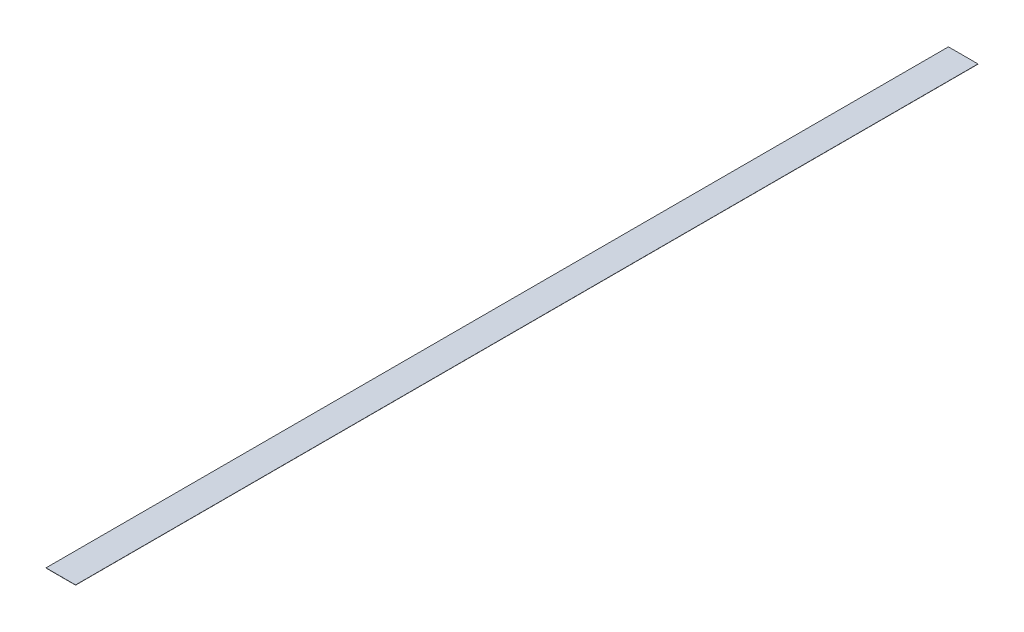
ISO-10303-21;
HEADER;
FILE_DESCRIPTION(('STEP AP214'),'2;1');
FILE_NAME('part.step','',(''),(''),'','','');
FILE_SCHEMA(('AUTOMOTIVE_DESIGN { 1 0 10303 214 1 1 1 1 }'));
ENDSEC;
DATA;
#1=APPLICATION_CONTEXT('core data for automotive mechanical design processes');
#2=APPLICATION_PROTOCOL_DEFINITION('international standard','automotive_design',2000,#1);
#3=PRODUCT_CONTEXT('',#1,'mechanical');
#4=PRODUCT('Part','Part','',(#3));
#5=PRODUCT_RELATED_PRODUCT_CATEGORY('part','',(#4));
#6=PRODUCT_DEFINITION_FORMATION('','',#4);
#7=PRODUCT_DEFINITION_CONTEXT('part definition',#1,'design');
#8=PRODUCT_DEFINITION('design','',#6,#7);
#9=PRODUCT_DEFINITION_SHAPE('','',#8);
#10=(LENGTH_UNIT() NAMED_UNIT(*) SI_UNIT(.MILLI.,.METRE.));
#11=(NAMED_UNIT(*) PLANE_ANGLE_UNIT() SI_UNIT($,.RADIAN.));
#12=(NAMED_UNIT(*) SI_UNIT($,.STERADIAN.) SOLID_ANGLE_UNIT());
#13=UNCERTAINTY_MEASURE_WITH_UNIT(LENGTH_MEASURE(1.E-05),#10,'distance_accuracy_value','');
#14=(GEOMETRIC_REPRESENTATION_CONTEXT(3) GLOBAL_UNCERTAINTY_ASSIGNED_CONTEXT((#13)) GLOBAL_UNIT_ASSIGNED_CONTEXT((#10,
#11,#12)) REPRESENTATION_CONTEXT('',''));
#15=CARTESIAN_POINT('',(0.,0.,0.));
#16=DIRECTION('',(0.,0.,1.));
#17=DIRECTION('',(1.,0.,0.));
#18=AXIS2_PLACEMENT_3D('',#15,#16,#17);
#19=CARTESIAN_POINT('',(0.,0.1,0.));
#20=DIRECTION('',(0.,0.,-1.));
#21=DIRECTION('',(-1.,0.,0.));
#22=AXIS2_PLACEMENT_3D('',#19,#20,#21);
#23=PLANE('',#22);
#24=DIRECTION('',(1.,0.,0.));
#25=VECTOR('',#24,1.);
#26=CARTESIAN_POINT('',(0.,0.,0.));
#27=LINE('',#26,#25);
#28=CARTESIAN_POINT('',(0.,0.,0.));
#29=VERTEX_POINT('',#28);
#30=CARTESIAN_POINT('',(14.9999999999999,0.,0.));
#31=VERTEX_POINT('',#30);
#32=EDGE_CURVE('E99',#29,#31,#27,.T.);
#33=ORIENTED_EDGE('',*,*,#32,.F.);
#34=DIRECTION('',(0.,-1.,0.));
#35=VECTOR('',#34,1.);
#36=CARTESIAN_POINT('',(0.,0.1,0.));
#37=LINE('',#36,#35);
#38=CARTESIAN_POINT('',(0.,0.1,0.));
#39=VERTEX_POINT('',#38);
#40=EDGE_CURVE('E11',#39,#29,#37,.T.);
#41=ORIENTED_EDGE('',*,*,#40,.F.);
#42=DIRECTION('',(1.,0.,0.));
#43=VECTOR('',#42,1.);
#44=CARTESIAN_POINT('',(0.,0.1,0.));
#45=LINE('',#44,#43);
#46=CARTESIAN_POINT('',(14.9999999999999,0.1,0.));
#47=VERTEX_POINT('',#46);
#48=EDGE_CURVE('E94',#39,#47,#45,.T.);
#49=ORIENTED_EDGE('',*,*,#48,.T.);
#50=DIRECTION('',(0.,-1.,0.));
#51=VECTOR('',#50,1.);
#52=CARTESIAN_POINT('',(14.9999999999999,0.1,0.));
#53=LINE('',#52,#51);
#54=EDGE_CURVE('E37',#47,#31,#53,.T.);
#55=ORIENTED_EDGE('',*,*,#54,.T.);
#56=EDGE_LOOP('',(#33,#41,#49,#55));
#57=FACE_BOUND('',#56,.T.);
#58=ADVANCED_FACE('F34',(#57),#23,.T.);
#59=CARTESIAN_POINT('',(0.,0.1,0.));
#60=DIRECTION('',(1.,0.,0.));
#61=DIRECTION('',(0.,0.,-1.));
#62=AXIS2_PLACEMENT_3D('',#59,#60,#61);
#63=PLANE('',#62);
#64=DIRECTION('',(0.,0.,1.));
#65=VECTOR('',#64,1.);
#66=CARTESIAN_POINT('',(0.,0.,0.));
#67=LINE('',#66,#65);
#68=CARTESIAN_POINT('',(0.,0.,457.6));
#69=VERTEX_POINT('',#68);
#70=EDGE_CURVE('E67',#29,#69,#67,.T.);
#71=ORIENTED_EDGE('',*,*,#70,.T.);
#72=DIRECTION('',(0.,-1.,0.));
#73=VECTOR('',#72,1.);
#74=CARTESIAN_POINT('',(0.,0.1,457.6));
#75=LINE('',#74,#73);
#76=CARTESIAN_POINT('',(0.,0.1,457.6));
#77=VERTEX_POINT('',#76);
#78=EDGE_CURVE('E43',#77,#69,#75,.T.);
#79=ORIENTED_EDGE('',*,*,#78,.F.);
#80=DIRECTION('',(0.,0.,1.));
#81=VECTOR('',#80,1.);
#82=CARTESIAN_POINT('',(0.,0.1,0.));
#83=LINE('',#82,#81);
#84=EDGE_CURVE('E84',#39,#77,#83,.T.);
#85=ORIENTED_EDGE('',*,*,#84,.F.);
#86=ORIENTED_EDGE('',*,*,#40,.T.);
#87=EDGE_LOOP('',(#71,#79,#85,#86));
#88=FACE_BOUND('',#87,.T.);
#89=ADVANCED_FACE('F109',(#88),#63,.F.);
#90=CARTESIAN_POINT('',(0.,0.1,457.6));
#91=DIRECTION('',(0.,0.,-1.));
#92=DIRECTION('',(-1.,0.,0.));
#93=AXIS2_PLACEMENT_3D('',#90,#91,#92);
#94=PLANE('',#93);
#95=DIRECTION('',(1.,0.,0.));
#96=VECTOR('',#95,1.);
#97=CARTESIAN_POINT('',(0.,0.,457.6));
#98=LINE('',#97,#96);
#99=CARTESIAN_POINT('',(15.0000000000001,0.,457.6));
#100=VERTEX_POINT('',#99);
#101=EDGE_CURVE('E91',#69,#100,#98,.T.);
#102=ORIENTED_EDGE('',*,*,#101,.T.);
#103=DIRECTION('',(0.,-1.,0.));
#104=VECTOR('',#103,1.);
#105=CARTESIAN_POINT('',(15.0000000000001,0.1,457.6));
#106=LINE('',#105,#104);
#107=CARTESIAN_POINT('',(15.0000000000001,0.1,457.6));
#108=VERTEX_POINT('',#107);
#109=EDGE_CURVE('E88',#108,#100,#106,.T.);
#110=ORIENTED_EDGE('',*,*,#109,.F.);
#111=DIRECTION('',(1.,0.,0.));
#112=VECTOR('',#111,1.);
#113=CARTESIAN_POINT('',(0.,0.1,457.6));
#114=LINE('',#113,#112);
#115=EDGE_CURVE('E79',#77,#108,#114,.T.);
#116=ORIENTED_EDGE('',*,*,#115,.F.);
#117=ORIENTED_EDGE('',*,*,#78,.T.);
#118=EDGE_LOOP('',(#102,#110,#116,#117));
#119=FACE_BOUND('',#118,.T.);
#120=ADVANCED_FACE('F89',(#119),#94,.F.);
#121=CARTESIAN_POINT('',(14.9999999999999,0.1,0.));
#122=DIRECTION('',(1.,0.,0.));
#123=DIRECTION('',(0.,0.,-1.));
#124=AXIS2_PLACEMENT_3D('',#121,#122,#123);
#125=PLANE('',#124);
#126=DIRECTION('',(0.,0.,1.));
#127=VECTOR('',#126,1.);
#128=CARTESIAN_POINT('',(14.9999999999999,0.,0.));
#129=LINE('',#128,#127);
#130=EDGE_CURVE('E102',#31,#100,#129,.T.);
#131=ORIENTED_EDGE('',*,*,#130,.F.);
#132=ORIENTED_EDGE('',*,*,#54,.F.);
#133=DIRECTION('',(0.,0.,1.));
#134=VECTOR('',#133,1.);
#135=CARTESIAN_POINT('',(14.9999999999999,0.1,0.));
#136=LINE('',#135,#134);
#137=EDGE_CURVE('E83',#47,#108,#136,.T.);
#138=ORIENTED_EDGE('',*,*,#137,.T.);
#139=ORIENTED_EDGE('',*,*,#109,.T.);
#140=EDGE_LOOP('',(#131,#132,#138,#139));
#141=FACE_BOUND('',#140,.T.);
#142=ADVANCED_FACE('F93',(#141),#125,.T.);
#143=CARTESIAN_POINT('',(0.,0.1,0.));
#144=DIRECTION('',(0.,-1.,0.));
#145=DIRECTION('',(0.,0.,-1.));
#146=AXIS2_PLACEMENT_3D('',#143,#144,#145);
#147=PLANE('',#146);
#148=ORIENTED_EDGE('',*,*,#48,.F.);
#149=ORIENTED_EDGE('',*,*,#84,.T.);
#150=ORIENTED_EDGE('',*,*,#115,.T.);
#151=ORIENTED_EDGE('',*,*,#137,.F.);
#152=EDGE_LOOP('',(#148,#149,#150,#151));
#153=FACE_BOUND('',#152,.T.);
#154=ADVANCED_FACE('F82',(#153),#147,.F.);
#155=CARTESIAN_POINT('',(0.,0.,0.));
#156=DIRECTION('',(0.,-1.,0.));
#157=DIRECTION('',(0.,0.,-1.));
#158=AXIS2_PLACEMENT_3D('',#155,#156,#157);
#159=PLANE('',#158);
#160=ORIENTED_EDGE('',*,*,#32,.T.);
#161=ORIENTED_EDGE('',*,*,#130,.T.);
#162=ORIENTED_EDGE('',*,*,#101,.F.);
#163=ORIENTED_EDGE('',*,*,#70,.F.);
#164=EDGE_LOOP('',(#160,#161,#162,#163));
#165=FACE_BOUND('',#164,.T.);
#166=ADVANCED_FACE('F107',(#165),#159,.T.);
#167=CLOSED_SHELL('',(#58,#89,#120,#142,#154,#166));
#168=MANIFOLD_SOLID_BREP('B2',#167);
#169=ADVANCED_BREP_SHAPE_REPRESENTATION('',(#18,#168),#14);
#170=SHAPE_DEFINITION_REPRESENTATION(#9,#169);
ENDSEC;
END-ISO-10303-21;
